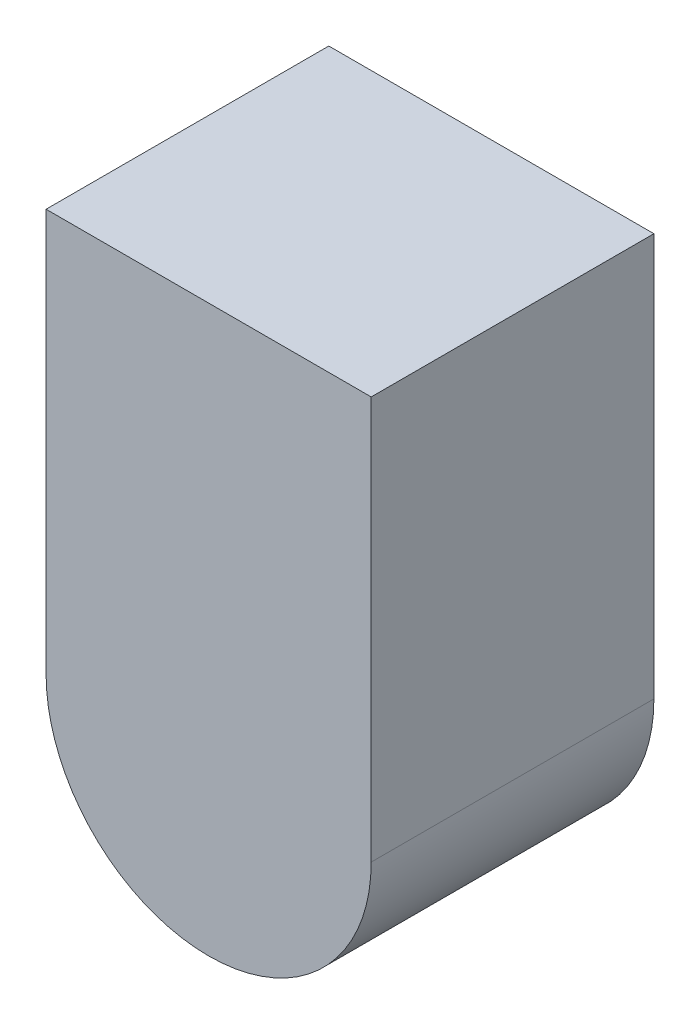
ISO-10303-21;
HEADER;
FILE_DESCRIPTION(('STEP AP214'),'2;1');
FILE_NAME('part.step','',(''),(''),'','','');
FILE_SCHEMA(('AUTOMOTIVE_DESIGN { 1 0 10303 214 1 1 1 1 }'));
ENDSEC;
DATA;
#1=APPLICATION_CONTEXT('core data for automotive mechanical design processes');
#2=APPLICATION_PROTOCOL_DEFINITION('international standard','automotive_design',2000,#1);
#3=PRODUCT_CONTEXT('',#1,'mechanical');
#4=PRODUCT('Part','Part','',(#3));
#5=PRODUCT_RELATED_PRODUCT_CATEGORY('part','',(#4));
#6=PRODUCT_DEFINITION_FORMATION('','',#4);
#7=PRODUCT_DEFINITION_CONTEXT('part definition',#1,'design');
#8=PRODUCT_DEFINITION('design','',#6,#7);
#9=PRODUCT_DEFINITION_SHAPE('','',#8);
#10=(LENGTH_UNIT() NAMED_UNIT(*) SI_UNIT(.MILLI.,.METRE.));
#11=(NAMED_UNIT(*) PLANE_ANGLE_UNIT() SI_UNIT($,.RADIAN.));
#12=(NAMED_UNIT(*) SI_UNIT($,.STERADIAN.) SOLID_ANGLE_UNIT());
#13=UNCERTAINTY_MEASURE_WITH_UNIT(LENGTH_MEASURE(1.E-05),#10,'distance_accuracy_value','');
#14=(GEOMETRIC_REPRESENTATION_CONTEXT(3) GLOBAL_UNCERTAINTY_ASSIGNED_CONTEXT((#13)) GLOBAL_UNIT_ASSIGNED_CONTEXT((#10,
#11,#12)) REPRESENTATION_CONTEXT('',''));
#15=CARTESIAN_POINT('',(0.,0.,0.));
#16=DIRECTION('',(0.,0.,1.));
#17=DIRECTION('',(1.,0.,0.));
#18=AXIS2_PLACEMENT_3D('',#15,#16,#17);
#19=CARTESIAN_POINT('',(0.250000000000001,2.8335240809167,0.2));
#20=DIRECTION('',(0.,0.,1.));
#21=DIRECTION('',(1.,0.,0.));
#22=AXIS2_PLACEMENT_3D('',#19,#20,#21);
#23=PLANE('',#22);
#24=DIRECTION('',(0.,1.,0.));
#25=VECTOR('',#24,1.);
#26=CARTESIAN_POINT('',(0.365000000000001,2.715,0.2));
#27=LINE('',#26,#25);
#28=CARTESIAN_POINT('',(0.365000000000001,2.715,0.2));
#29=VERTEX_POINT('',#28);
#30=CARTESIAN_POINT('',(0.365000000000001,3.,0.2));
#31=VERTEX_POINT('',#30);
#32=EDGE_CURVE('E11',#29,#31,#27,.T.);
#33=ORIENTED_EDGE('',*,*,#32,.T.);
#34=DIRECTION('',(-1.,0.,0.));
#35=VECTOR('',#34,1.);
#36=CARTESIAN_POINT('',(1.625,3.,0.2));
#37=LINE('',#36,#35);
#38=CARTESIAN_POINT('',(0.135000000000001,3.,0.2));
#39=VERTEX_POINT('',#38);
#40=EDGE_CURVE('E24',#31,#39,#37,.T.);
#41=ORIENTED_EDGE('',*,*,#40,.T.);
#42=DIRECTION('',(0.,-1.,0.));
#43=VECTOR('',#42,1.);
#44=CARTESIAN_POINT('',(0.135000000000001,3.,0.2));
#45=LINE('',#44,#43);
#46=CARTESIAN_POINT('',(0.135000000000001,2.715,0.2));
#47=VERTEX_POINT('',#46);
#48=EDGE_CURVE('E88',#39,#47,#45,.T.);
#49=ORIENTED_EDGE('',*,*,#48,.T.);
#50=CARTESIAN_POINT('',(0.25,2.715,0.2));
#51=DIRECTION('',(0.,0.,1.));
#52=DIRECTION('',(-1.,0.,0.));
#53=AXIS2_PLACEMENT_3D('',#50,#51,#52);
#54=CIRCLE('',#53,0.115);
#55=EDGE_CURVE('E70',#47,#29,#54,.T.);
#56=ORIENTED_EDGE('',*,*,#55,.T.);
#57=EDGE_LOOP('',(#33,#41,#49,#56));
#58=FACE_BOUND('',#57,.T.);
#59=ADVANCED_FACE('F17',(#58),#23,.T.);
#60=CARTESIAN_POINT('',(3.,3.,0.));
#61=DIRECTION('',(0.,1.,0.));
#62=DIRECTION('',(-1.,0.,0.));
#63=AXIS2_PLACEMENT_3D('',#60,#61,#62);
#64=PLANE('',#63);
#65=DIRECTION('',(0.,0.,-1.));
#66=VECTOR('',#65,1.);
#67=CARTESIAN_POINT('',(0.135000000000001,3.,0.));
#68=LINE('',#67,#66);
#69=CARTESIAN_POINT('',(0.135000000000001,3.,0.));
#70=VERTEX_POINT('',#69);
#71=EDGE_CURVE('E76',#39,#70,#68,.T.);
#72=ORIENTED_EDGE('',*,*,#71,.F.);
#73=ORIENTED_EDGE('',*,*,#40,.F.);
#74=DIRECTION('',(0.,0.,1.));
#75=VECTOR('',#74,1.);
#76=CARTESIAN_POINT('',(0.365000000000001,3.,0.));
#77=LINE('',#76,#75);
#78=CARTESIAN_POINT('',(0.365000000000001,3.,0.));
#79=VERTEX_POINT('',#78);
#80=EDGE_CURVE('E84',#79,#31,#77,.T.);
#81=ORIENTED_EDGE('',*,*,#80,.F.);
#82=DIRECTION('',(-1.,0.,0.));
#83=VECTOR('',#82,1.);
#84=CARTESIAN_POINT('',(0.365000000000001,3.,0.));
#85=LINE('',#84,#83);
#86=EDGE_CURVE('E82',#79,#70,#85,.T.);
#87=ORIENTED_EDGE('',*,*,#86,.T.);
#88=EDGE_LOOP('',(#72,#73,#81,#87));
#89=FACE_BOUND('',#88,.T.);
#90=ADVANCED_FACE('F90',(#89),#64,.T.);
#91=CARTESIAN_POINT('',(0.365000000000001,2.715,0.));
#92=DIRECTION('',(1.,0.,0.));
#93=DIRECTION('',(0.,1.,0.));
#94=AXIS2_PLACEMENT_3D('',#91,#92,#93);
#95=PLANE('',#94);
#96=DIRECTION('',(0.,1.,0.));
#97=VECTOR('',#96,1.);
#98=CARTESIAN_POINT('',(0.365000000000001,2.715,0.));
#99=LINE('',#98,#97);
#100=CARTESIAN_POINT('',(0.365000000000001,2.715,0.));
#101=VERTEX_POINT('',#100);
#102=EDGE_CURVE('E61',#101,#79,#99,.T.);
#103=ORIENTED_EDGE('',*,*,#102,.T.);
#104=ORIENTED_EDGE('',*,*,#80,.T.);
#105=ORIENTED_EDGE('',*,*,#32,.F.);
#106=DIRECTION('',(0.,0.,1.));
#107=VECTOR('',#106,1.);
#108=CARTESIAN_POINT('',(0.365000000000001,2.715,0.));
#109=LINE('',#108,#107);
#110=EDGE_CURVE('E64',#101,#29,#109,.T.);
#111=ORIENTED_EDGE('',*,*,#110,.F.);
#112=EDGE_LOOP('',(#103,#104,#105,#111));
#113=FACE_BOUND('',#112,.T.);
#114=ADVANCED_FACE('F91',(#113),#95,.T.);
#115=CARTESIAN_POINT('',(0.25,2.715,0.));
#116=DIRECTION('',(0.,0.,1.));
#117=DIRECTION('',(-1.,0.,0.));
#118=AXIS2_PLACEMENT_3D('',#115,#116,#117);
#119=CYLINDRICAL_SURFACE('',#118,0.115);
#120=CARTESIAN_POINT('',(0.25,2.715,0.));
#121=DIRECTION('',(0.,0.,1.));
#122=DIRECTION('',(-1.,0.,0.));
#123=AXIS2_PLACEMENT_3D('',#120,#121,#122);
#124=CIRCLE('',#123,0.115);
#125=CARTESIAN_POINT('',(0.135000000000001,2.715,0.));
#126=VERTEX_POINT('',#125);
#127=EDGE_CURVE('E54',#126,#101,#124,.T.);
#128=ORIENTED_EDGE('',*,*,#127,.T.);
#129=ORIENTED_EDGE('',*,*,#110,.T.);
#130=ORIENTED_EDGE('',*,*,#55,.F.);
#131=DIRECTION('',(0.,0.,1.));
#132=VECTOR('',#131,1.);
#133=CARTESIAN_POINT('',(0.135000000000001,2.715,0.));
#134=LINE('',#133,#132);
#135=EDGE_CURVE('E65',#126,#47,#134,.T.);
#136=ORIENTED_EDGE('',*,*,#135,.F.);
#137=EDGE_LOOP('',(#128,#129,#130,#136));
#138=FACE_BOUND('',#137,.T.);
#139=ADVANCED_FACE('F69',(#138),#119,.T.);
#140=CARTESIAN_POINT('',(0.135000000000001,3.,0.));
#141=DIRECTION('',(-1.,0.,0.));
#142=DIRECTION('',(0.,-1.,0.));
#143=AXIS2_PLACEMENT_3D('',#140,#141,#142);
#144=PLANE('',#143);
#145=DIRECTION('',(0.,-1.,0.));
#146=VECTOR('',#145,1.);
#147=CARTESIAN_POINT('',(0.135000000000001,3.,0.));
#148=LINE('',#147,#146);
#149=EDGE_CURVE('E59',#70,#126,#148,.T.);
#150=ORIENTED_EDGE('',*,*,#149,.T.);
#151=ORIENTED_EDGE('',*,*,#135,.T.);
#152=ORIENTED_EDGE('',*,*,#48,.F.);
#153=ORIENTED_EDGE('',*,*,#71,.T.);
#154=EDGE_LOOP('',(#150,#151,#152,#153));
#155=FACE_BOUND('',#154,.T.);
#156=ADVANCED_FACE('F74',(#155),#144,.T.);
#157=CARTESIAN_POINT('',(0.250000000000001,2.8335265642716,0.));
#158=DIRECTION('',(0.,0.,1.));
#159=DIRECTION('',(0.,-1.,0.));
#160=AXIS2_PLACEMENT_3D('',#157,#158,#159);
#161=PLANE('',#160);
#162=ORIENTED_EDGE('',*,*,#86,.F.);
#163=ORIENTED_EDGE('',*,*,#102,.F.);
#164=ORIENTED_EDGE('',*,*,#127,.F.);
#165=ORIENTED_EDGE('',*,*,#149,.F.);
#166=EDGE_LOOP('',(#162,#163,#164,#165));
#167=FACE_BOUND('',#166,.T.);
#168=ADVANCED_FACE('F57',(#167),#161,.F.);
#169=CLOSED_SHELL('',(#59,#90,#114,#139,#156,#168));
#170=MANIFOLD_SOLID_BREP('B1',#169);
#171=ADVANCED_BREP_SHAPE_REPRESENTATION('',(#18,#170),#14);
#172=SHAPE_DEFINITION_REPRESENTATION(#9,#171);
ENDSEC;
END-ISO-10303-21;
